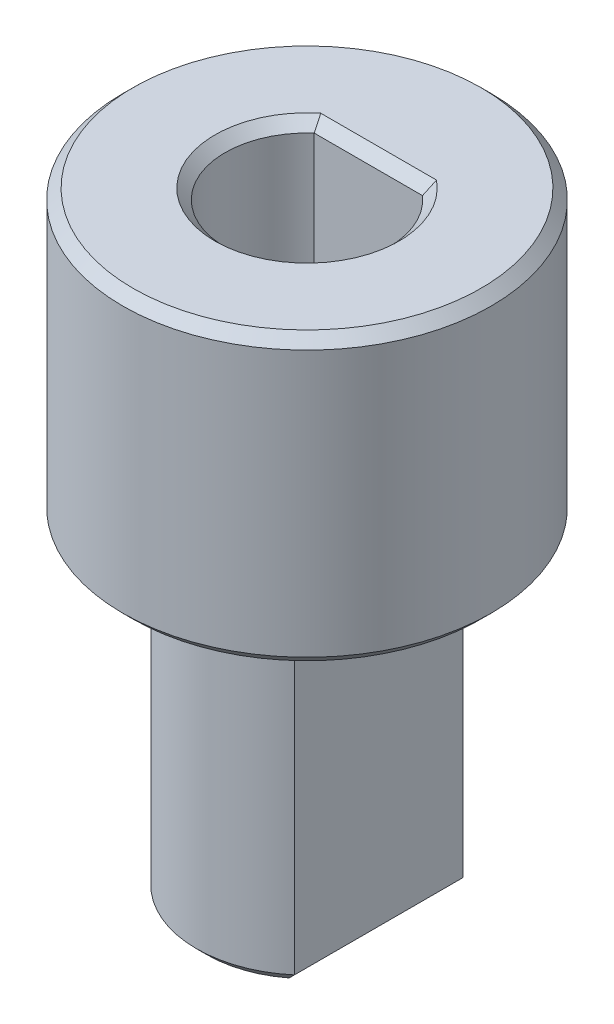
ISO-10303-21;
HEADER;
FILE_DESCRIPTION(('STEP AP214'),'2;1');
FILE_NAME('part.step','',(''),(''),'','','');
FILE_SCHEMA(('AUTOMOTIVE_DESIGN { 1 0 10303 214 1 1 1 1 }'));
ENDSEC;
DATA;
#1=APPLICATION_CONTEXT('core data for automotive mechanical design processes');
#2=APPLICATION_PROTOCOL_DEFINITION('international standard','automotive_design',2000,#1);
#3=PRODUCT_CONTEXT('',#1,'mechanical');
#4=PRODUCT('Part','Part','',(#3));
#5=PRODUCT_RELATED_PRODUCT_CATEGORY('part','',(#4));
#6=PRODUCT_DEFINITION_FORMATION('','',#4);
#7=PRODUCT_DEFINITION_CONTEXT('part definition',#1,'design');
#8=PRODUCT_DEFINITION('design','',#6,#7);
#9=PRODUCT_DEFINITION_SHAPE('','',#8);
#10=(LENGTH_UNIT() NAMED_UNIT(*) SI_UNIT(.MILLI.,.METRE.));
#11=(NAMED_UNIT(*) PLANE_ANGLE_UNIT() SI_UNIT($,.RADIAN.));
#12=(NAMED_UNIT(*) SI_UNIT($,.STERADIAN.) SOLID_ANGLE_UNIT());
#13=UNCERTAINTY_MEASURE_WITH_UNIT(LENGTH_MEASURE(1.E-05),#10,'distance_accuracy_value','');
#14=(GEOMETRIC_REPRESENTATION_CONTEXT(3) GLOBAL_UNCERTAINTY_ASSIGNED_CONTEXT((#13)) GLOBAL_UNIT_ASSIGNED_CONTEXT((#10,
#11,#12)) REPRESENTATION_CONTEXT('',''));
#15=CARTESIAN_POINT('',(0.,0.,0.));
#16=DIRECTION('',(0.,0.,1.));
#17=DIRECTION('',(1.,0.,0.));
#18=AXIS2_PLACEMENT_3D('',#15,#16,#17);
#19=CARTESIAN_POINT('',(0.,8.,0.));
#20=DIRECTION('',(0.,-1.,0.));
#21=DIRECTION('',(0.,0.,-1.));
#22=AXIS2_PLACEMENT_3D('',#19,#20,#21);
#23=CYLINDRICAL_SURFACE('',#22,2.7);
#24=DIRECTION('',(0.,-1.,0.));
#25=VECTOR('',#24,1.);
#26=CARTESIAN_POINT('',(1.75,8.,-2.05608851949521));
#27=LINE('',#26,#25);
#28=CARTESIAN_POINT('',(1.75,7.5,-2.05608851949521));
#29=VERTEX_POINT('',#28);
#30=CARTESIAN_POINT('',(1.75,0.250000000000005,-2.05608851949521));
#31=VERTEX_POINT('',#30);
#32=EDGE_CURVE('E154',#29,#31,#27,.T.);
#33=ORIENTED_EDGE('',*,*,#32,.T.);
#34=CARTESIAN_POINT('',(0.,0.250000000000005,0.));
#35=DIRECTION('',(0.,1.,0.));
#36=DIRECTION('',(0.,0.,1.));
#37=AXIS2_PLACEMENT_3D('',#34,#35,#36);
#38=CIRCLE('',#37,2.7);
#39=CARTESIAN_POINT('',(-1.75,0.250000000000005,-2.05608851949521));
#40=VERTEX_POINT('',#39);
#41=EDGE_CURVE('E359',#31,#40,#38,.T.);
#42=ORIENTED_EDGE('',*,*,#41,.T.);
#43=DIRECTION('',(0.,-1.,0.));
#44=VECTOR('',#43,1.);
#45=CARTESIAN_POINT('',(-1.75,8.,-2.05608851949521));
#46=LINE('',#45,#44);
#47=CARTESIAN_POINT('',(-1.75,7.5,-2.05608851949521));
#48=VERTEX_POINT('',#47);
#49=EDGE_CURVE('E167',#48,#40,#46,.T.);
#50=ORIENTED_EDGE('',*,*,#49,.F.);
#51=CARTESIAN_POINT('',(0.,7.5,0.));
#52=DIRECTION('',(0.,1.,0.));
#53=DIRECTION('',(0.,0.,1.));
#54=AXIS2_PLACEMENT_3D('',#51,#52,#53);
#55=CIRCLE('',#54,2.7);
#56=EDGE_CURVE('E194',#48,#29,#55,.F.);
#57=ORIENTED_EDGE('',*,*,#56,.T.);
#58=EDGE_LOOP('',(#33,#42,#50,#57));
#59=FACE_BOUND('',#58,.T.);
#60=ADVANCED_FACE('F41',(#59),#23,.T.);
#61=CARTESIAN_POINT('',(-1.75,8.,-2.05608851949521));
#62=DIRECTION('',(1.,0.,0.));
#63=DIRECTION('',(0.,0.,-1.));
#64=AXIS2_PLACEMENT_3D('',#61,#62,#63);
#65=PLANE('',#64);
#66=ORIENTED_EDGE('',*,*,#49,.T.);
#67=DIRECTION('',(0.,0.,1.));
#68=VECTOR('',#67,1.);
#69=CARTESIAN_POINT('',(-1.75,0.250000000000005,-2.05608851949521));
#70=LINE('',#69,#68);
#71=CARTESIAN_POINT('',(-1.75,0.250000000000005,2.05608851949521));
#72=VERTEX_POINT('',#71);
#73=EDGE_CURVE('E353',#40,#72,#70,.T.);
#74=ORIENTED_EDGE('',*,*,#73,.T.);
#75=DIRECTION('',(0.,-1.,0.));
#76=VECTOR('',#75,1.);
#77=CARTESIAN_POINT('',(-1.75,8.,2.05608851949521));
#78=LINE('',#77,#76);
#79=CARTESIAN_POINT('',(-1.75,7.5,2.05608851949521));
#80=VERTEX_POINT('',#79);
#81=EDGE_CURVE('E163',#80,#72,#78,.T.);
#82=ORIENTED_EDGE('',*,*,#81,.F.);
#83=DIRECTION('',(0.,0.,1.));
#84=VECTOR('',#83,1.);
#85=CARTESIAN_POINT('',(-1.75,7.5,-2.05608851949521));
#86=LINE('',#85,#84);
#87=EDGE_CURVE('E191',#80,#48,#86,.F.);
#88=ORIENTED_EDGE('',*,*,#87,.T.);
#89=EDGE_LOOP('',(#66,#74,#82,#88));
#90=FACE_BOUND('',#89,.T.);
#91=ADVANCED_FACE('F369',(#90),#65,.F.);
#92=CARTESIAN_POINT('',(0.,8.,0.));
#93=DIRECTION('',(0.,-1.,0.));
#94=DIRECTION('',(0.,0.,-1.));
#95=AXIS2_PLACEMENT_3D('',#92,#93,#94);
#96=CYLINDRICAL_SURFACE('',#95,2.7);
#97=ORIENTED_EDGE('',*,*,#81,.T.);
#98=CARTESIAN_POINT('',(0.,0.250000000000005,0.));
#99=DIRECTION('',(0.,1.,0.));
#100=DIRECTION('',(0.,0.,1.));
#101=AXIS2_PLACEMENT_3D('',#98,#99,#100);
#102=CIRCLE('',#101,2.7);
#103=CARTESIAN_POINT('',(1.75,0.250000000000005,2.05608851949521));
#104=VERTEX_POINT('',#103);
#105=EDGE_CURVE('E350',#72,#104,#102,.T.);
#106=ORIENTED_EDGE('',*,*,#105,.T.);
#107=DIRECTION('',(0.,-1.,0.));
#108=VECTOR('',#107,1.);
#109=CARTESIAN_POINT('',(1.75,8.,2.05608851949521));
#110=LINE('',#109,#108);
#111=CARTESIAN_POINT('',(1.75,7.5,2.05608851949521));
#112=VERTEX_POINT('',#111);
#113=EDGE_CURVE('E159',#112,#104,#110,.T.);
#114=ORIENTED_EDGE('',*,*,#113,.F.);
#115=CARTESIAN_POINT('',(0.,7.5,0.));
#116=DIRECTION('',(0.,1.,0.));
#117=DIRECTION('',(0.,0.,1.));
#118=AXIS2_PLACEMENT_3D('',#115,#116,#117);
#119=CIRCLE('',#118,2.7);
#120=EDGE_CURVE('E188',#112,#80,#119,.F.);
#121=ORIENTED_EDGE('',*,*,#120,.T.);
#122=EDGE_LOOP('',(#97,#106,#114,#121));
#123=FACE_BOUND('',#122,.T.);
#124=ADVANCED_FACE('F410',(#123),#96,.T.);
#125=CARTESIAN_POINT('',(1.75,8.,-2.05608851949521));
#126=DIRECTION('',(-1.,0.,0.));
#127=DIRECTION('',(0.,0.,1.));
#128=AXIS2_PLACEMENT_3D('',#125,#126,#127);
#129=PLANE('',#128);
#130=ORIENTED_EDGE('',*,*,#113,.T.);
#131=DIRECTION('',(0.,0.,-1.));
#132=VECTOR('',#131,1.);
#133=CARTESIAN_POINT('',(1.75,0.250000000000005,-2.05608851949521));
#134=LINE('',#133,#132);
#135=EDGE_CURVE('E335',#104,#31,#134,.T.);
#136=ORIENTED_EDGE('',*,*,#135,.T.);
#137=ORIENTED_EDGE('',*,*,#32,.F.);
#138=DIRECTION('',(0.,0.,-1.));
#139=VECTOR('',#138,1.);
#140=CARTESIAN_POINT('',(1.75,7.5,2.05608851949521));
#141=LINE('',#140,#139);
#142=EDGE_CURVE('E184',#29,#112,#141,.F.);
#143=ORIENTED_EDGE('',*,*,#142,.T.);
#144=EDGE_LOOP('',(#130,#136,#137,#143));
#145=FACE_BOUND('',#144,.T.);
#146=ADVANCED_FACE('F415',(#145),#129,.F.);
#147=CARTESIAN_POINT('',(0.,0.,0.));
#148=DIRECTION('',(0.,1.,0.));
#149=DIRECTION('',(0.,0.,1.));
#150=AXIS2_PLACEMENT_3D('',#147,#148,#149);
#151=PLANE('',#150);
#152=CARTESIAN_POINT('',(0.,0.,0.));
#153=DIRECTION('',(0.,1.,0.));
#154=DIRECTION('',(0.,0.,1.));
#155=AXIS2_PLACEMENT_3D('',#152,#153,#154);
#156=CIRCLE('',#155,2.45);
#157=CARTESIAN_POINT('',(-1.49999999999993,0.,-1.9371370627811));
#158=VERTEX_POINT('',#157);
#159=CARTESIAN_POINT('',(1.49999999999993,0.,-1.9371370627811));
#160=VERTEX_POINT('',#159);
#161=EDGE_CURVE('E348',#158,#160,#156,.F.);
#162=ORIENTED_EDGE('',*,*,#161,.T.);
#163=DIRECTION('',(0.,0.,1.));
#164=VECTOR('',#163,1.);
#165=CARTESIAN_POINT('',(1.5,0.,0.));
#166=LINE('',#165,#164);
#167=CARTESIAN_POINT('',(1.49999999999993,0.,1.9371370627811));
#168=VERTEX_POINT('',#167);
#169=EDGE_CURVE('E333',#160,#168,#166,.T.);
#170=ORIENTED_EDGE('',*,*,#169,.T.);
#171=CARTESIAN_POINT('',(0.,0.,0.));
#172=DIRECTION('',(0.,1.,0.));
#173=DIRECTION('',(0.,0.,1.));
#174=AXIS2_PLACEMENT_3D('',#171,#172,#173);
#175=CIRCLE('',#174,2.45);
#176=CARTESIAN_POINT('',(-1.5,0.,1.9371370627811));
#177=VERTEX_POINT('',#176);
#178=EDGE_CURVE('E339',#168,#177,#175,.F.);
#179=ORIENTED_EDGE('',*,*,#178,.T.);
#180=DIRECTION('',(0.,0.,-1.));
#181=VECTOR('',#180,1.);
#182=CARTESIAN_POINT('',(-1.5,0.,0.));
#183=LINE('',#182,#181);
#184=EDGE_CURVE('E344',#177,#158,#183,.T.);
#185=ORIENTED_EDGE('',*,*,#184,.T.);
#186=EDGE_LOOP('',(#162,#170,#179,#185));
#187=FACE_BOUND('',#186,.T.);
#188=ADVANCED_FACE('F346',(#187),#151,.F.);
#189=CARTESIAN_POINT('',(0.,8.,0.));
#190=DIRECTION('',(0.,1.,0.));
#191=DIRECTION('',(0.,0.,1.));
#192=AXIS2_PLACEMENT_3D('',#189,#190,#191);
#193=PLANE('',#192);
#194=CARTESIAN_POINT('',(0.,8.,0.));
#195=DIRECTION('',(0.,1.,0.));
#196=DIRECTION('',(0.,0.,1.));
#197=AXIS2_PLACEMENT_3D('',#194,#195,#196);
#198=CIRCLE('',#197,4.25);
#199=CARTESIAN_POINT('',(0.,8.,4.25));
#200=VERTEX_POINT('',#199);
#201=EDGE_CURVE('E377',#200,#200,#198,.F.);
#202=ORIENTED_EDGE('',*,*,#201,.T.);
#203=EDGE_LOOP('',(#202));
#204=FACE_BOUND('',#203,.T.);
#205=CARTESIAN_POINT('',(0.,8.,0.));
#206=DIRECTION('',(0.,1.,0.));
#207=DIRECTION('',(0.,0.,1.));
#208=AXIS2_PLACEMENT_3D('',#205,#206,#207);
#209=CIRCLE('',#208,3.2);
#210=CARTESIAN_POINT('',(-2.25,8.,2.27541205059655));
#211=VERTEX_POINT('',#210);
#212=CARTESIAN_POINT('',(2.25,8.,2.27541205059655));
#213=VERTEX_POINT('',#212);
#214=EDGE_CURVE('E177',#211,#213,#209,.T.);
#215=ORIENTED_EDGE('',*,*,#214,.T.);
#216=DIRECTION('',(0.,0.,-1.));
#217=VECTOR('',#216,1.);
#218=CARTESIAN_POINT('',(2.25,8.,-2.05608851949521));
#219=LINE('',#218,#217);
#220=CARTESIAN_POINT('',(2.25,8.,-2.27541205059655));
#221=VERTEX_POINT('',#220);
#222=EDGE_CURVE('E180',#213,#221,#219,.T.);
#223=ORIENTED_EDGE('',*,*,#222,.T.);
#224=CARTESIAN_POINT('',(0.,8.,0.));
#225=DIRECTION('',(0.,1.,0.));
#226=DIRECTION('',(0.,0.,1.));
#227=AXIS2_PLACEMENT_3D('',#224,#225,#226);
#228=CIRCLE('',#227,3.2);
#229=CARTESIAN_POINT('',(-2.25,8.,-2.27541205059655));
#230=VERTEX_POINT('',#229);
#231=EDGE_CURVE('E171',#221,#230,#228,.T.);
#232=ORIENTED_EDGE('',*,*,#231,.T.);
#233=DIRECTION('',(0.,0.,1.));
#234=VECTOR('',#233,1.);
#235=CARTESIAN_POINT('',(-2.25,8.,2.05608851949521));
#236=LINE('',#235,#234);
#237=EDGE_CURVE('E174',#230,#211,#236,.T.);
#238=ORIENTED_EDGE('',*,*,#237,.T.);
#239=EDGE_LOOP('',(#215,#223,#232,#238));
#240=FACE_BOUND('',#239,.T.);
#241=ADVANCED_FACE('F422',(#204,#240),#193,.F.);
#242=CARTESIAN_POINT('',(0.,15.,0.));
#243=DIRECTION('',(0.,-1.,0.));
#244=DIRECTION('',(0.,0.,-1.));
#245=AXIS2_PLACEMENT_3D('',#242,#243,#244);
#246=CYLINDRICAL_SURFACE('',#245,4.5);
#247=CARTESIAN_POINT('',(0.,14.75,0.));
#248=DIRECTION('',(0.,1.,0.));
#249=DIRECTION('',(0.,0.,1.));
#250=AXIS2_PLACEMENT_3D('',#247,#248,#249);
#251=CIRCLE('',#250,4.5);
#252=CARTESIAN_POINT('',(0.,14.75,4.5));
#253=VERTEX_POINT('',#252);
#254=EDGE_CURVE('E383',#253,#253,#251,.F.);
#255=ORIENTED_EDGE('',*,*,#254,.T.);
#256=EDGE_LOOP('',(#255));
#257=FACE_BOUND('',#256,.T.);
#258=CARTESIAN_POINT('',(0.,8.24999999999999,0.));
#259=DIRECTION('',(0.,1.,0.));
#260=DIRECTION('',(0.,0.,1.));
#261=AXIS2_PLACEMENT_3D('',#258,#259,#260);
#262=CIRCLE('',#261,4.5);
#263=CARTESIAN_POINT('',(0.,8.24999999999999,4.5));
#264=VERTEX_POINT('',#263);
#265=EDGE_CURVE('E387',#264,#264,#262,.T.);
#266=ORIENTED_EDGE('',*,*,#265,.T.);
#267=EDGE_LOOP('',(#266));
#268=FACE_BOUND('',#267,.T.);
#269=ADVANCED_FACE('F423',(#257,#268),#246,.T.);
#270=CARTESIAN_POINT('',(0.,15.,0.));
#271=DIRECTION('',(0.,1.,0.));
#272=DIRECTION('',(0.,0.,1.));
#273=AXIS2_PLACEMENT_3D('',#270,#271,#272);
#274=PLANE('',#273);
#275=CARTESIAN_POINT('',(0.,15.,0.));
#276=DIRECTION('',(0.,1.,0.));
#277=DIRECTION('',(0.,0.,1.));
#278=AXIS2_PLACEMENT_3D('',#275,#276,#277);
#279=CIRCLE('',#278,4.25);
#280=CARTESIAN_POINT('',(0.,15.,4.25));
#281=VERTEX_POINT('',#280);
#282=EDGE_CURVE('E391',#281,#281,#279,.T.);
#283=ORIENTED_EDGE('',*,*,#282,.T.);
#284=EDGE_LOOP('',(#283));
#285=FACE_BOUND('',#284,.T.);
#286=CARTESIAN_POINT('',(0.,15.,0.));
#287=DIRECTION('',(0.,1.,0.));
#288=DIRECTION('',(0.,0.,1.));
#289=AXIS2_PLACEMENT_3D('',#286,#287,#288);
#290=CIRCLE('',#289,2.25);
#291=CARTESIAN_POINT('',(1.41421356237368,15.,-1.74999999999953));
#292=VERTEX_POINT('',#291);
#293=CARTESIAN_POINT('',(-1.41421356237368,15.,-1.74999999999953));
#294=VERTEX_POINT('',#293);
#295=EDGE_CURVE('E197',#292,#294,#290,.F.);
#296=ORIENTED_EDGE('',*,*,#295,.T.);
#297=DIRECTION('',(1.,0.,0.));
#298=VECTOR('',#297,1.);
#299=CARTESIAN_POINT('',(1.3228756555323,15.,-1.75));
#300=LINE('',#299,#298);
#301=EDGE_CURVE('E395',#294,#292,#300,.T.);
#302=ORIENTED_EDGE('',*,*,#301,.T.);
#303=EDGE_LOOP('',(#296,#302));
#304=FACE_BOUND('',#303,.T.);
#305=ADVANCED_FACE('F400',(#285,#304),#274,.T.);
#306=CARTESIAN_POINT('',(0.,9.5,0.));
#307=DIRECTION('',(0.,1.,0.));
#308=DIRECTION('',(0.,0.,1.));
#309=AXIS2_PLACEMENT_3D('',#306,#307,#308);
#310=CYLINDRICAL_SURFACE('',#309,2.);
#311=DIRECTION('',(0.,1.,0.));
#312=VECTOR('',#311,1.);
#313=CARTESIAN_POINT('',(-1.3228756555323,9.5,-1.5));
#314=LINE('',#313,#312);
#315=CARTESIAN_POINT('',(-1.3228756555323,9.5,-1.5));
#316=VERTEX_POINT('',#315);
#317=CARTESIAN_POINT('',(-1.3228756555323,14.75,-1.5));
#318=VERTEX_POINT('',#317);
#319=EDGE_CURVE('E141',#316,#318,#314,.T.);
#320=ORIENTED_EDGE('',*,*,#319,.T.);
#321=CARTESIAN_POINT('',(0.,14.75,0.));
#322=DIRECTION('',(0.,1.,0.));
#323=DIRECTION('',(0.,0.,1.));
#324=AXIS2_PLACEMENT_3D('',#321,#322,#323);
#325=CIRCLE('',#324,2.);
#326=CARTESIAN_POINT('',(1.3228756555323,14.75,-1.5));
#327=VERTEX_POINT('',#326);
#328=EDGE_CURVE('E11',#318,#327,#325,.T.);
#329=ORIENTED_EDGE('',*,*,#328,.T.);
#330=DIRECTION('',(0.,1.,0.));
#331=VECTOR('',#330,1.);
#332=CARTESIAN_POINT('',(1.3228756555323,9.5,-1.5));
#333=LINE('',#332,#331);
#334=CARTESIAN_POINT('',(1.3228756555323,9.5,-1.5));
#335=VERTEX_POINT('',#334);
#336=EDGE_CURVE('E131',#335,#327,#333,.T.);
#337=ORIENTED_EDGE('',*,*,#336,.F.);
#338=CARTESIAN_POINT('',(0.,9.5,0.));
#339=DIRECTION('',(0.,1.,0.));
#340=DIRECTION('',(0.,0.,1.));
#341=AXIS2_PLACEMENT_3D('',#338,#339,#340);
#342=CIRCLE('',#341,2.);
#343=EDGE_CURVE('E134',#316,#335,#342,.T.);
#344=ORIENTED_EDGE('',*,*,#343,.F.);
#345=EDGE_LOOP('',(#320,#329,#337,#344));
#346=FACE_BOUND('',#345,.T.);
#347=ADVANCED_FACE('F133',(#346),#310,.F.);
#348=CARTESIAN_POINT('',(-1.3228756555323,9.5,-1.5));
#349=DIRECTION('',(0.,0.,-1.));
#350=DIRECTION('',(-1.,0.,0.));
#351=AXIS2_PLACEMENT_3D('',#348,#349,#350);
#352=PLANE('',#351);
#353=ORIENTED_EDGE('',*,*,#336,.T.);
#354=DIRECTION('',(-1.,0.,0.));
#355=VECTOR('',#354,1.);
#356=CARTESIAN_POINT('',(-1.3228756555323,14.75,-1.5));
#357=LINE('',#356,#355);
#358=EDGE_CURVE('E57',#327,#318,#357,.T.);
#359=ORIENTED_EDGE('',*,*,#358,.T.);
#360=ORIENTED_EDGE('',*,*,#319,.F.);
#361=DIRECTION('',(-1.,0.,0.));
#362=VECTOR('',#361,1.);
#363=CARTESIAN_POINT('',(-1.3228756555323,9.5,-1.5));
#364=LINE('',#363,#362);
#365=EDGE_CURVE('E142',#335,#316,#364,.T.);
#366=ORIENTED_EDGE('',*,*,#365,.F.);
#367=EDGE_LOOP('',(#353,#359,#360,#366));
#368=FACE_BOUND('',#367,.T.);
#369=ADVANCED_FACE('F149',(#368),#352,.F.);
#370=CARTESIAN_POINT('',(0.,9.5,0.));
#371=DIRECTION('',(0.,1.,0.));
#372=DIRECTION('',(0.,0.,1.));
#373=AXIS2_PLACEMENT_3D('',#370,#371,#372);
#374=PLANE('',#373);
#375=ORIENTED_EDGE('',*,*,#343,.T.);
#376=ORIENTED_EDGE('',*,*,#365,.T.);
#377=EDGE_LOOP('',(#375,#376));
#378=FACE_BOUND('',#377,.T.);
#379=ADVANCED_FACE('F145',(#378),#374,.T.);
#380=CARTESIAN_POINT('',(-2.25,7.5,0.));
#381=DIRECTION('',(0.,0.,-1.));
#382=DIRECTION('',(-1.,0.,0.));
#383=AXIS2_PLACEMENT_3D('',#380,#381,#382);
#384=CYLINDRICAL_SURFACE('',#383,0.5);
#385=CARTESIAN_POINT('',(-1.75,7.5,-2.05608851949521));
#386=CARTESIAN_POINT('',(-1.74996919922262,7.52632260652865,-2.05607178102168));
#387=CARTESIAN_POINT('',(-1.75207644331631,7.55262165590065,-2.0570479324666));
#388=CARTESIAN_POINT('',(-1.76032121230071,7.6043550129189,-2.06085336453355));
#389=CARTESIAN_POINT('',(-1.76644516375054,7.62979193053666,-2.06367640398524));
#390=CARTESIAN_POINT('',(-1.78247637551992,7.67915751360458,-2.0710426735546));
#391=CARTESIAN_POINT('',(-1.79238169358972,7.70308694601593,-2.07558502056218));
#392=CARTESIAN_POINT('',(-1.81558504998242,7.74888282012401,-2.08617826305488));
#393=CARTESIAN_POINT('',(-1.82888497964632,7.77074810242568,-2.09222999946805));
#394=CARTESIAN_POINT('',(-1.85901107267241,7.81276556424669,-2.10586540819539));
#395=CARTESIAN_POINT('',(-1.87595586855051,7.83281582533292,-2.11350019126156));
#396=CARTESIAN_POINT('',(-1.91249174896519,7.86981722777497,-2.12985943839794));
#397=CARTESIAN_POINT('',(-1.93208371293864,7.88676733478041,-2.13858426452719));
#398=CARTESIAN_POINT('',(-1.97517610465316,7.91862946950742,-2.15764523421604));
#399=CARTESIAN_POINT('',(-1.99886806411994,7.93323797892125,-2.16805548353674));
#400=CARTESIAN_POINT('',(-2.04810816767597,7.95826045940945,-2.18952523066229));
#401=CARTESIAN_POINT('',(-2.07365706121899,7.96867272567009,-2.20058499025817));
#402=CARTESIAN_POINT('',(-2.12336488706764,7.98432861069836,-2.22193517245373));
#403=CARTESIAN_POINT('',(-2.14741050396874,7.98998231203844,-2.232193162565));
#404=CARTESIAN_POINT('',(-2.1960033799222,7.99768200060645,-2.25277871694376));
#405=CARTESIAN_POINT('',(-2.22054949868329,7.99973542477366,-2.26310609345093));
#406=CARTESIAN_POINT('',(-2.24673749772129,7.9999920348521,-2.27404963032802));
#407=CARTESIAN_POINT('',(-2.24836876405467,8.00000001986969,-2.27473100120077));
#408=CARTESIAN_POINT('',(-2.25,8.,-2.27541205059655));
#409=B_SPLINE_CURVE_WITH_KNOTS('',3,(#385,#386,#387,#388,#389,#390,#391,#392,#393,#394,#395,
#396,#397,#398,#399,#400,#401,#402,#403,#404,#405,#406,#407,#408),.UNSPECIFIED.,.F.,.F.,(4,2,2,
2,2,2,2,2,2,2,2,4),(0.,0.0788287972848369,0.157392575689543,0.235916055008417,0.314483380319386,
0.396157210040283,0.477858240299897,0.566632974792478,0.655443739653088,0.735449739088215,
0.815290277964193,0.820593800195262),.UNSPECIFIED.);
#410=EDGE_CURVE('E226',#48,#230,#409,.T.);
#411=ORIENTED_EDGE('',*,*,#410,.F.);
#412=ORIENTED_EDGE('',*,*,#87,.F.);
#413=CARTESIAN_POINT('',(-1.75,7.5,2.05608851949521));
#414=CARTESIAN_POINT('',(-1.74996919922262,7.52632260652865,2.05607178102168));
#415=CARTESIAN_POINT('',(-1.75207644331631,7.55262165590065,2.0570479324666));
#416=CARTESIAN_POINT('',(-1.76032121230071,7.6043550129189,2.06085336453355));
#417=CARTESIAN_POINT('',(-1.76644516375054,7.62979193053666,2.06367640398524));
#418=CARTESIAN_POINT('',(-1.78247637551992,7.67915751360458,2.0710426735546));
#419=CARTESIAN_POINT('',(-1.79238169358972,7.70308694601593,2.07558502056218));
#420=CARTESIAN_POINT('',(-1.81558504998242,7.74888282012401,2.08617826305488));
#421=CARTESIAN_POINT('',(-1.82888497964632,7.77074810242568,2.09222999946805));
#422=CARTESIAN_POINT('',(-1.85901107267241,7.81276556424669,2.10586540819539));
#423=CARTESIAN_POINT('',(-1.87595586855051,7.83281582533292,2.11350019126156));
#424=CARTESIAN_POINT('',(-1.91249174896519,7.86981722777497,2.12985943839794));
#425=CARTESIAN_POINT('',(-1.93208371293864,7.88676733478041,2.13858426452719));
#426=CARTESIAN_POINT('',(-1.97517610465316,7.91862946950742,2.15764523421604));
#427=CARTESIAN_POINT('',(-1.99886806411994,7.93323797892125,2.16805548353674));
#428=CARTESIAN_POINT('',(-2.04810816767597,7.95826045940945,2.18952523066229));
#429=CARTESIAN_POINT('',(-2.07365706121899,7.96867272567009,2.20058499025817));
#430=CARTESIAN_POINT('',(-2.12336488706764,7.98432861069836,2.22193517245373));
#431=CARTESIAN_POINT('',(-2.14741050396874,7.98998231203844,2.232193162565));
#432=CARTESIAN_POINT('',(-2.1960033799222,7.99768200060645,2.25277871694376));
#433=CARTESIAN_POINT('',(-2.22054949868329,7.99973542477366,2.26310609345093));
#434=CARTESIAN_POINT('',(-2.24673749772129,7.9999920348521,2.27404963032802));
#435=CARTESIAN_POINT('',(-2.24836876405467,8.00000001986969,2.27473100120077));
#436=CARTESIAN_POINT('',(-2.25,8.,2.27541205059655));
#437=B_SPLINE_CURVE_WITH_KNOTS('',3,(#413,#414,#415,#416,#417,#418,#419,#420,#421,#422,#423,
#424,#425,#426,#427,#428,#429,#430,#431,#432,#433,#434,#435,#436),.UNSPECIFIED.,.F.,.F.,(4,2,2,
2,2,2,2,2,2,2,2,4),(0.,0.0788287972848369,0.157392575689543,0.235916055008417,0.314483380319386,
0.396157210040283,0.477858240299897,0.566632974792478,0.655443739653088,0.735449739088215,
0.815290277964193,0.820593800195262),.UNSPECIFIED.);
#438=EDGE_CURVE('E147',#211,#80,#437,.F.);
#439=ORIENTED_EDGE('',*,*,#438,.F.);
#440=ORIENTED_EDGE('',*,*,#237,.F.);
#441=EDGE_LOOP('',(#411,#412,#439,#440));
#442=FACE_BOUND('',#441,.T.);
#443=ADVANCED_FACE('F239',(#442),#384,.F.);
#444=CARTESIAN_POINT('',(0.,7.5,0.));
#445=DIRECTION('',(0.,1.,0.));
#446=DIRECTION('',(0.,0.,1.));
#447=AXIS2_PLACEMENT_3D('',#444,#445,#446);
#448=TOROIDAL_SURFACE('',#447,3.2,0.5);
#449=ORIENTED_EDGE('',*,*,#438,.T.);
#450=ORIENTED_EDGE('',*,*,#120,.F.);
#451=CARTESIAN_POINT('',(1.75,7.5,2.05608851949521));
#452=CARTESIAN_POINT('',(1.74996919922262,7.52632260652865,2.05607178102168));
#453=CARTESIAN_POINT('',(1.75207644331631,7.55262165590065,2.0570479324666));
#454=CARTESIAN_POINT('',(1.76032121230071,7.6043550129189,2.06085336453355));
#455=CARTESIAN_POINT('',(1.76644516375054,7.62979193053666,2.06367640398523));
#456=CARTESIAN_POINT('',(1.78247637551992,7.67915751360458,2.0710426735546));
#457=CARTESIAN_POINT('',(1.79238169358972,7.70308694601593,2.07558502056218));
#458=CARTESIAN_POINT('',(1.81558504998242,7.74888282012401,2.08617826305488));
#459=CARTESIAN_POINT('',(1.82888497964632,7.77074810242568,2.09222999946805));
#460=CARTESIAN_POINT('',(1.85901107267241,7.81276556424669,2.10586540819539));
#461=CARTESIAN_POINT('',(1.87595586855051,7.83281582533292,2.11350019126156));
#462=CARTESIAN_POINT('',(1.91249174896519,7.86981722777497,2.12985943839794));
#463=CARTESIAN_POINT('',(1.93208371293865,7.88676733478041,2.13858426452719));
#464=CARTESIAN_POINT('',(1.97517610465316,7.91862946950742,2.15764523421603));
#465=CARTESIAN_POINT('',(1.99886806411994,7.93323797892125,2.16805548353673));
#466=CARTESIAN_POINT('',(2.04810816767597,7.95826045940945,2.18952523066229));
#467=CARTESIAN_POINT('',(2.07365706121899,7.96867272567009,2.20058499025818));
#468=CARTESIAN_POINT('',(2.12336488706765,7.98432861069836,2.22193517245373));
#469=CARTESIAN_POINT('',(2.14741050396875,7.98998231203844,2.23219316256498));
#470=CARTESIAN_POINT('',(2.1960033799222,7.99768200060645,2.25277871694378));
#471=CARTESIAN_POINT('',(2.22054949868327,7.99973542477366,2.26310609345099));
#472=CARTESIAN_POINT('',(2.24673749772129,7.9999920348521,2.27404963032802));
#473=CARTESIAN_POINT('',(2.24836876405467,8.00000001986969,2.27473100120078));
#474=CARTESIAN_POINT('',(2.25,8.,2.27541205059655));
#475=B_SPLINE_CURVE_WITH_KNOTS('',3,(#451,#452,#453,#454,#455,#456,#457,#458,#459,#460,#461,
#462,#463,#464,#465,#466,#467,#468,#469,#470,#471,#472,#473,#474),.UNSPECIFIED.,.F.,.F.,(4,2,2,
2,2,2,2,2,2,2,2,4),(0.,0.0788287972848369,0.157392575689543,0.235916055008417,0.314483380319386,
0.396157210040283,0.477858240299897,0.566632974792477,0.655443739653087,0.735449739088216,
0.815290277964193,0.820593800195262),.UNSPECIFIED.);
#476=EDGE_CURVE('E207',#213,#112,#475,.F.);
#477=ORIENTED_EDGE('',*,*,#476,.F.);
#478=ORIENTED_EDGE('',*,*,#214,.F.);
#479=EDGE_LOOP('',(#449,#450,#477,#478));
#480=FACE_BOUND('',#479,.T.);
#481=ADVANCED_FACE('F221',(#480),#448,.F.);
#482=CARTESIAN_POINT('',(0.,7.5,0.));
#483=DIRECTION('',(0.,1.,0.));
#484=DIRECTION('',(0.,0.,1.));
#485=AXIS2_PLACEMENT_3D('',#482,#483,#484);
#486=TOROIDAL_SURFACE('',#485,3.2,0.5);
#487=ORIENTED_EDGE('',*,*,#410,.T.);
#488=ORIENTED_EDGE('',*,*,#231,.F.);
#489=CARTESIAN_POINT('',(1.75,7.5,-2.05608851949521));
#490=CARTESIAN_POINT('',(1.74996919922262,7.52632260652865,-2.05607178102168));
#491=CARTESIAN_POINT('',(1.75207644331631,7.55262165590065,-2.0570479324666));
#492=CARTESIAN_POINT('',(1.76032121230071,7.6043550129189,-2.06085336453355));
#493=CARTESIAN_POINT('',(1.76644516375054,7.62979193053666,-2.06367640398523));
#494=CARTESIAN_POINT('',(1.78247637551992,7.67915751360458,-2.0710426735546));
#495=CARTESIAN_POINT('',(1.79238169358972,7.70308694601593,-2.07558502056218));
#496=CARTESIAN_POINT('',(1.81558504998242,7.74888282012401,-2.08617826305488));
#497=CARTESIAN_POINT('',(1.82888497964632,7.77074810242568,-2.09222999946805));
#498=CARTESIAN_POINT('',(1.85901107267241,7.81276556424669,-2.10586540819539));
#499=CARTESIAN_POINT('',(1.87595586855051,7.83281582533292,-2.11350019126156));
#500=CARTESIAN_POINT('',(1.91249174896519,7.86981722777497,-2.12985943839794));
#501=CARTESIAN_POINT('',(1.93208371293865,7.88676733478041,-2.13858426452719));
#502=CARTESIAN_POINT('',(1.97517610465316,7.91862946950742,-2.15764523421603));
#503=CARTESIAN_POINT('',(1.99886806411994,7.93323797892125,-2.16805548353673));
#504=CARTESIAN_POINT('',(2.04810816767597,7.95826045940945,-2.18952523066229));
#505=CARTESIAN_POINT('',(2.07365706121899,7.96867272567009,-2.20058499025818));
#506=CARTESIAN_POINT('',(2.12336488706765,7.98432861069836,-2.22193517245373));
#507=CARTESIAN_POINT('',(2.14741050396875,7.98998231203844,-2.23219316256498));
#508=CARTESIAN_POINT('',(2.1960033799222,7.99768200060645,-2.25277871694378));
#509=CARTESIAN_POINT('',(2.22054949868327,7.99973542477366,-2.26310609345099));
#510=CARTESIAN_POINT('',(2.24673749772129,7.9999920348521,-2.27404963032802));
#511=CARTESIAN_POINT('',(2.24836876405467,8.00000001986969,-2.27473100120078));
#512=CARTESIAN_POINT('',(2.25,8.,-2.27541205059655));
#513=B_SPLINE_CURVE_WITH_KNOTS('',3,(#489,#490,#491,#492,#493,#494,#495,#496,#497,#498,#499,
#500,#501,#502,#503,#504,#505,#506,#507,#508,#509,#510,#511,#512),.UNSPECIFIED.,.F.,.F.,(4,2,2,
2,2,2,2,2,2,2,2,4),(0.,0.0788287972848369,0.157392575689543,0.235916055008417,0.314483380319386,
0.396157210040283,0.477858240299897,0.566632974792477,0.655443739653087,0.735449739088216,
0.815290277964193,0.820593800195262),.UNSPECIFIED.);
#514=EDGE_CURVE('E198',#29,#221,#513,.T.);
#515=ORIENTED_EDGE('',*,*,#514,.F.);
#516=ORIENTED_EDGE('',*,*,#56,.F.);
#517=EDGE_LOOP('',(#487,#488,#515,#516));
#518=FACE_BOUND('',#517,.T.);
#519=ADVANCED_FACE('F218',(#518),#486,.F.);
#520=CARTESIAN_POINT('',(2.25,7.5,0.));
#521=DIRECTION('',(0.,0.,1.));
#522=DIRECTION('',(1.,0.,0.));
#523=AXIS2_PLACEMENT_3D('',#520,#521,#522);
#524=CYLINDRICAL_SURFACE('',#523,0.5);
#525=ORIENTED_EDGE('',*,*,#476,.T.);
#526=ORIENTED_EDGE('',*,*,#142,.F.);
#527=ORIENTED_EDGE('',*,*,#514,.T.);
#528=ORIENTED_EDGE('',*,*,#222,.F.);
#529=EDGE_LOOP('',(#525,#526,#527,#528));
#530=FACE_BOUND('',#529,.T.);
#531=ADVANCED_FACE('F215',(#530),#524,.F.);
#532=CARTESIAN_POINT('',(0.,15.,0.));
#533=DIRECTION('',(0.,-1.,0.));
#534=DIRECTION('',(0.,0.,-1.));
#535=AXIS2_PLACEMENT_3D('',#532,#533,#534);
#536=CONICAL_SURFACE('',#535,4.25,0.785398163397447);
#537=ORIENTED_EDGE('',*,*,#254,.F.);
#538=EDGE_LOOP('',(#537));
#539=FACE_BOUND('',#538,.T.);
#540=ORIENTED_EDGE('',*,*,#282,.F.);
#541=EDGE_LOOP('',(#540));
#542=FACE_BOUND('',#541,.T.);
#543=ADVANCED_FACE('F245',(#539,#542),#536,.T.);
#544=CARTESIAN_POINT('',(0.,8.24999999999999,0.));
#545=DIRECTION('',(0.,1.,0.));
#546=DIRECTION('',(0.,0.,1.));
#547=AXIS2_PLACEMENT_3D('',#544,#545,#546);
#548=CONICAL_SURFACE('',#547,4.5,0.785398163397457);
#549=ORIENTED_EDGE('',*,*,#201,.F.);
#550=EDGE_LOOP('',(#549));
#551=FACE_BOUND('',#550,.T.);
#552=ORIENTED_EDGE('',*,*,#265,.F.);
#553=EDGE_LOOP('',(#552));
#554=FACE_BOUND('',#553,.T.);
#555=ADVANCED_FACE('F252',(#551,#554),#548,.T.);
#556=CARTESIAN_POINT('',(-1.75,0.250000000000005,-2.05608851949521));
#557=DIRECTION('',(0.707106781186549,0.707106781186546,0.));
#558=DIRECTION('',(0.,0.,1.));
#559=AXIS2_PLACEMENT_3D('',#556,#557,#558);
#560=PLANE('',#559);
#561=CARTESIAN_POINT('',(-1.5,0.,-1.93713706278118));
#562=CARTESIAN_POINT('',(-1.54154052042679,0.0415405204268001,-1.95749273988808));
#563=CARTESIAN_POINT('',(-1.58314413453005,0.0831441345300548,-1.9775832093249));
#564=CARTESIAN_POINT('',(-1.66647746811162,0.166477468111627,-2.0172336938528));
#565=CARTESIAN_POINT('',(-1.70820718734167,0.208207187341675,-2.03679370998746));
#566=CARTESIAN_POINT('',(-1.7499999999999,0.249999999999908,-2.05608851949561));
#567=B_SPLINE_CURVE_WITH_KNOTS('',3,(#561,#562,#563,#564,#565,#566),.UNSPECIFIED.,.F.,.F.,(4,2,
4),(0.,0.186515777820187,0.37303118867685),.UNSPECIFIED.);
#568=EDGE_CURVE('E283',#158,#40,#567,.T.);
#569=ORIENTED_EDGE('',*,*,#568,.F.);
#570=ORIENTED_EDGE('',*,*,#184,.F.);
#571=CARTESIAN_POINT('',(-1.49999999999993,0.,1.9371370627811));
#572=CARTESIAN_POINT('',(-1.54154052042675,0.0415405204267852,1.95749273988804));
#573=CARTESIAN_POINT('',(-1.58314413453002,0.0831441345300326,1.97758320932487));
#574=CARTESIAN_POINT('',(-1.66647746811161,0.166477468111604,2.0172336938528));
#575=CARTESIAN_POINT('',(-1.70820718734166,0.20820718734166,2.03679370998747));
#576=CARTESIAN_POINT('',(-1.7499999999999,0.249999999999908,2.05608851949561));
#577=B_SPLINE_CURVE_WITH_KNOTS('',3,(#571,#572,#573,#574,#575,#576),.UNSPECIFIED.,.F.,.F.,(4,2,
4),(0.,0.186515777820221,0.373031188676917),.UNSPECIFIED.);
#578=EDGE_CURVE('E208',#72,#177,#577,.F.);
#579=ORIENTED_EDGE('',*,*,#578,.F.);
#580=ORIENTED_EDGE('',*,*,#73,.F.);
#581=EDGE_LOOP('',(#569,#570,#579,#580));
#582=FACE_BOUND('',#581,.T.);
#583=ADVANCED_FACE('F259',(#582),#560,.F.);
#584=CARTESIAN_POINT('',(0.,0.250000000000005,0.));
#585=DIRECTION('',(0.,1.,0.));
#586=DIRECTION('',(0.,0.,1.));
#587=AXIS2_PLACEMENT_3D('',#584,#585,#586);
#588=CONICAL_SURFACE('',#587,2.7,0.785398163397447);
#589=ORIENTED_EDGE('',*,*,#578,.T.);
#590=ORIENTED_EDGE('',*,*,#178,.F.);
#591=CARTESIAN_POINT('',(1.5,0.,1.93713706278118));
#592=CARTESIAN_POINT('',(1.5415405204268,0.0415405204268001,1.95749273988808));
#593=CARTESIAN_POINT('',(1.58314413453005,0.0831441345300549,1.9775832093249));
#594=CARTESIAN_POINT('',(1.66647746811162,0.166477468111627,2.0172336938528));
#595=CARTESIAN_POINT('',(1.70820718734167,0.208207187341675,2.03679370998746));
#596=CARTESIAN_POINT('',(1.7499999999999,0.249999999999908,2.05608851949561));
#597=B_SPLINE_CURVE_WITH_KNOTS('',3,(#591,#592,#593,#594,#595,#596),.UNSPECIFIED.,.F.,.F.,(4,2,
4),(0.,0.186515777820187,0.37303118867685),.UNSPECIFIED.);
#598=EDGE_CURVE('E292',#104,#168,#597,.F.);
#599=ORIENTED_EDGE('',*,*,#598,.F.);
#600=ORIENTED_EDGE('',*,*,#105,.F.);
#601=EDGE_LOOP('',(#589,#590,#599,#600));
#602=FACE_BOUND('',#601,.T.);
#603=ADVANCED_FACE('F270',(#602),#588,.T.);
#604=CARTESIAN_POINT('',(0.,0.250000000000005,0.));
#605=DIRECTION('',(0.,1.,0.));
#606=DIRECTION('',(0.,0.,1.));
#607=AXIS2_PLACEMENT_3D('',#604,#605,#606);
#608=CONICAL_SURFACE('',#607,2.7,0.785398163397447);
#609=ORIENTED_EDGE('',*,*,#568,.T.);
#610=ORIENTED_EDGE('',*,*,#41,.F.);
#611=CARTESIAN_POINT('',(1.75,0.250000000000005,-2.05608851949521));
#612=CARTESIAN_POINT('',(1.70820718734173,0.208207187341732,-2.03679370998724));
#613=CARTESIAN_POINT('',(1.66647746811165,0.166477468111652,-2.01723369385271));
#614=CARTESIAN_POINT('',(1.58314413453003,0.0831441345300339,-1.97758320932499));
#615=CARTESIAN_POINT('',(1.54154052042676,0.0415405204267648,-1.95749273988824));
#616=CARTESIAN_POINT('',(1.49999999999995,0.,-1.93713706278135));
#617=B_SPLINE_CURVE_WITH_KNOTS('',3,(#611,#612,#613,#614,#615,#616),.UNSPECIFIED.,.F.,.F.,(4,2,
4),(0.,0.186515410856666,0.373031188676854),.UNSPECIFIED.);
#618=EDGE_CURVE('E276',#160,#31,#617,.F.);
#619=ORIENTED_EDGE('',*,*,#618,.F.);
#620=ORIENTED_EDGE('',*,*,#161,.F.);
#621=EDGE_LOOP('',(#609,#610,#619,#620));
#622=FACE_BOUND('',#621,.T.);
#623=ADVANCED_FACE('F262',(#622),#608,.T.);
#624=CARTESIAN_POINT('',(1.75,0.250000000000005,-2.05608851949521));
#625=DIRECTION('',(-0.707106781186549,0.707106781186546,0.));
#626=DIRECTION('',(0.,0.,-1.));
#627=AXIS2_PLACEMENT_3D('',#624,#625,#626);
#628=PLANE('',#627);
#629=ORIENTED_EDGE('',*,*,#598,.T.);
#630=ORIENTED_EDGE('',*,*,#169,.F.);
#631=ORIENTED_EDGE('',*,*,#618,.T.);
#632=ORIENTED_EDGE('',*,*,#135,.F.);
#633=EDGE_LOOP('',(#629,#630,#631,#632));
#634=FACE_BOUND('',#633,.T.);
#635=ADVANCED_FACE('F269',(#634),#628,.F.);
#636=CARTESIAN_POINT('',(0.,14.75,0.));
#637=DIRECTION('',(0.,1.,0.));
#638=DIRECTION('',(0.,0.,1.));
#639=AXIS2_PLACEMENT_3D('',#636,#637,#638);
#640=CONICAL_SURFACE('',#639,2.,0.785398163397452);
#641=CARTESIAN_POINT('',(-1.3228756555323,14.75,-1.5));
#642=CARTESIAN_POINT('',(-1.33857475349556,14.7915797349402,-1.54157973494024));
#643=CARTESIAN_POINT('',(-1.35403580179615,14.8332029557956,-1.58320295579562));
#644=CARTESIAN_POINT('',(-1.384481769829,14.916536289296,-1.66653628929599));
#645=CARTESIAN_POINT('',(-1.39946669047584,14.9582464017739,-1.70824640177392));
#646=CARTESIAN_POINT('',(-1.41421356237457,14.9999999999999,-1.7499999999999));
#647=B_SPLINE_CURVE_WITH_KNOTS('',3,(#641,#642,#643,#644,#645,#646),.UNSPECIFIED.,.F.,.F.,(4,2,
4),(0.,0.182582204471665,0.365164058207765),.UNSPECIFIED.);
#648=EDGE_CURVE('E71',#294,#318,#647,.F.);
#649=ORIENTED_EDGE('',*,*,#648,.F.);
#650=ORIENTED_EDGE('',*,*,#295,.F.);
#651=CARTESIAN_POINT('',(1.41421356237406,15.,-1.75));
#652=CARTESIAN_POINT('',(1.3994666904754,14.958246401774,-1.708246401774));
#653=CARTESIAN_POINT('',(1.38448176982873,14.916536289296,-1.66653628929604));
#654=CARTESIAN_POINT('',(1.35403580179643,14.8332029557956,-1.58320295579557));
#655=CARTESIAN_POINT('',(1.33857475349621,14.7915797349401,-1.54157973494013));
#656=CARTESIAN_POINT('',(1.32287565553341,14.7499999999998,-1.4999999999998));
#657=B_SPLINE_CURVE_WITH_KNOTS('',3,(#651,#652,#653,#654,#655,#656),.UNSPECIFIED.,.F.,.F.,(4,2,
4),(0.,0.1825818537361,0.365164058207759),.UNSPECIFIED.);
#658=EDGE_CURVE('E47',#327,#292,#657,.F.);
#659=ORIENTED_EDGE('',*,*,#658,.F.);
#660=ORIENTED_EDGE('',*,*,#328,.F.);
#661=EDGE_LOOP('',(#649,#650,#659,#660));
#662=FACE_BOUND('',#661,.T.);
#663=ADVANCED_FACE('F44',(#662),#640,.F.);
#664=CARTESIAN_POINT('',(-1.3228756555323,14.75,-1.5));
#665=DIRECTION('',(0.,0.70710678118655,0.707106781186545));
#666=DIRECTION('',(1.,0.,0.));
#667=AXIS2_PLACEMENT_3D('',#664,#665,#666);
#668=PLANE('',#667);
#669=ORIENTED_EDGE('',*,*,#658,.T.);
#670=ORIENTED_EDGE('',*,*,#301,.F.);
#671=ORIENTED_EDGE('',*,*,#648,.T.);
#672=ORIENTED_EDGE('',*,*,#358,.F.);
#673=EDGE_LOOP('',(#669,#670,#671,#672));
#674=FACE_BOUND('',#673,.T.);
#675=ADVANCED_FACE('F309',(#674),#668,.T.);
#676=CLOSED_SHELL('',(#60,#91,#124,#146,#188,#241,#269,#305,#347,#369,#379,#443,#481,#519,#531,
#543,#555,#583,#603,#623,#635,#663,#675));
#677=MANIFOLD_SOLID_BREP('B2',#676);
#678=ADVANCED_BREP_SHAPE_REPRESENTATION('',(#18,#677),#14);
#679=SHAPE_DEFINITION_REPRESENTATION(#9,#678);
ENDSEC;
END-ISO-10303-21;
